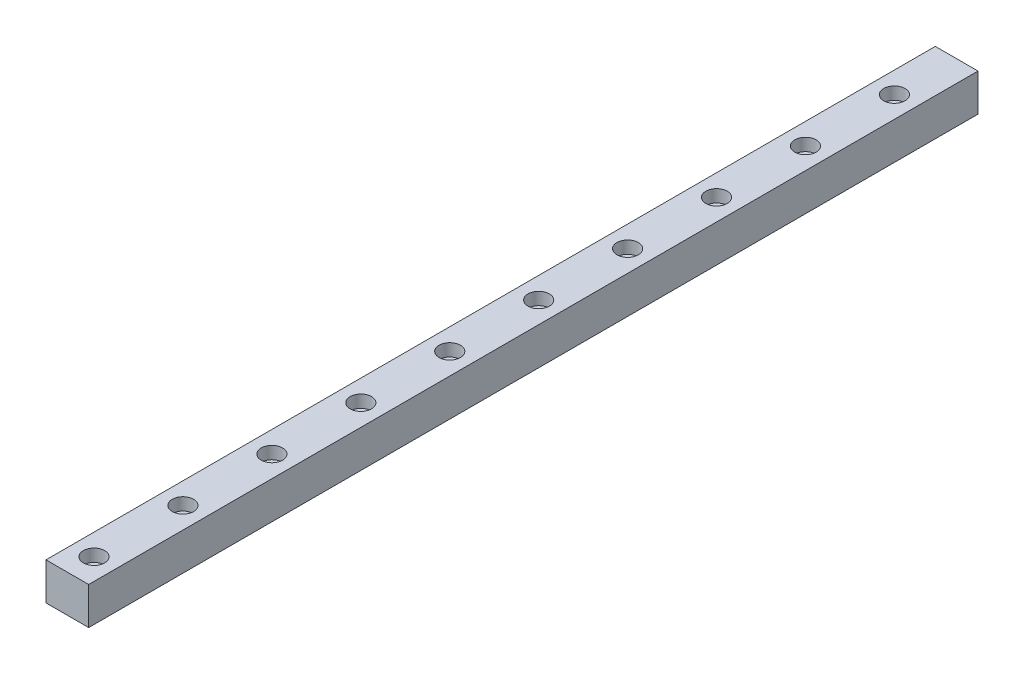
ISO-10303-21;
HEADER;
FILE_DESCRIPTION(('STEP AP214'),'2;1');
FILE_NAME('part.step','',(''),(''),'','','');
FILE_SCHEMA(('AUTOMOTIVE_DESIGN { 1 0 10303 214 1 1 1 1 }'));
ENDSEC;
DATA;
#1=APPLICATION_CONTEXT('core data for automotive mechanical design processes');
#2=APPLICATION_PROTOCOL_DEFINITION('international standard','automotive_design',2000,#1);
#3=PRODUCT_CONTEXT('',#1,'mechanical');
#4=PRODUCT('Part','Part','',(#3));
#5=PRODUCT_RELATED_PRODUCT_CATEGORY('part','',(#4));
#6=PRODUCT_DEFINITION_FORMATION('','',#4);
#7=PRODUCT_DEFINITION_CONTEXT('part definition',#1,'design');
#8=PRODUCT_DEFINITION('design','',#6,#7);
#9=PRODUCT_DEFINITION_SHAPE('','',#8);
#10=(LENGTH_UNIT() NAMED_UNIT(*) SI_UNIT(.MILLI.,.METRE.));
#11=(NAMED_UNIT(*) PLANE_ANGLE_UNIT() SI_UNIT($,.RADIAN.));
#12=(NAMED_UNIT(*) SI_UNIT($,.STERADIAN.) SOLID_ANGLE_UNIT());
#13=UNCERTAINTY_MEASURE_WITH_UNIT(LENGTH_MEASURE(1.E-05),#10,'distance_accuracy_value','');
#14=(GEOMETRIC_REPRESENTATION_CONTEXT(3) GLOBAL_UNCERTAINTY_ASSIGNED_CONTEXT((#13)) GLOBAL_UNIT_ASSIGNED_CONTEXT((#10,
#11,#12)) REPRESENTATION_CONTEXT('',''));
#15=CARTESIAN_POINT('',(0.,0.,0.));
#16=DIRECTION('',(0.,0.,1.));
#17=DIRECTION('',(1.,0.,0.));
#18=AXIS2_PLACEMENT_3D('',#15,#16,#17);
#19=CARTESIAN_POINT('',(0.,0.,250.));
#20=DIRECTION('',(1.,0.,0.));
#21=DIRECTION('',(0.,0.,-1.));
#22=AXIS2_PLACEMENT_3D('',#19,#20,#21);
#23=PLANE('',#22);
#24=DIRECTION('',(0.,-1.,0.));
#25=VECTOR('',#24,1.);
#26=CARTESIAN_POINT('',(0.,0.,0.));
#27=LINE('',#26,#25);
#28=CARTESIAN_POINT('',(0.,10.5,0.));
#29=VERTEX_POINT('',#28);
#30=CARTESIAN_POINT('',(0.,0.,0.));
#31=VERTEX_POINT('',#30);
#32=EDGE_CURVE('E101',#29,#31,#27,.T.);
#33=ORIENTED_EDGE('',*,*,#32,.T.);
#34=DIRECTION('',(0.,0.,-1.));
#35=VECTOR('',#34,1.);
#36=CARTESIAN_POINT('',(0.,0.,250.));
#37=LINE('',#36,#35);
#38=CARTESIAN_POINT('',(0.,0.,250.));
#39=VERTEX_POINT('',#38);
#40=EDGE_CURVE('E11',#39,#31,#37,.T.);
#41=ORIENTED_EDGE('',*,*,#40,.F.);
#42=DIRECTION('',(0.,-1.,0.));
#43=VECTOR('',#42,1.);
#44=CARTESIAN_POINT('',(0.,0.,250.));
#45=LINE('',#44,#43);
#46=CARTESIAN_POINT('',(0.,10.5,250.));
#47=VERTEX_POINT('',#46);
#48=EDGE_CURVE('E89',#47,#39,#45,.T.);
#49=ORIENTED_EDGE('',*,*,#48,.F.);
#50=DIRECTION('',(0.,0.,-1.));
#51=VECTOR('',#50,1.);
#52=CARTESIAN_POINT('',(0.,10.5,250.));
#53=LINE('',#52,#51);
#54=EDGE_CURVE('E97',#47,#29,#53,.T.);
#55=ORIENTED_EDGE('',*,*,#54,.T.);
#56=EDGE_LOOP('',(#33,#41,#49,#55));
#57=FACE_BOUND('',#56,.T.);
#58=ADVANCED_FACE('F38',(#57),#23,.F.);
#59=CARTESIAN_POINT('',(0.,0.,250.));
#60=DIRECTION('',(0.,1.,0.));
#61=DIRECTION('',(0.,0.,1.));
#62=AXIS2_PLACEMENT_3D('',#59,#60,#61);
#63=PLANE('',#62);
#64=CARTESIAN_POINT('',(6.00000000000001,0.,17.5));
#65=DIRECTION('',(0.,1.,0.));
#66=DIRECTION('',(0.,0.,1.));
#67=AXIS2_PLACEMENT_3D('',#64,#65,#66);
#68=CIRCLE('',#67,1.75);
#69=CARTESIAN_POINT('',(6.00000000000001,0.,19.25));
#70=VERTEX_POINT('',#69);
#71=EDGE_CURVE('E231',#70,#70,#68,.T.);
#72=ORIENTED_EDGE('',*,*,#71,.T.);
#73=EDGE_LOOP('',(#72));
#74=FACE_BOUND('',#73,.T.);
#75=CARTESIAN_POINT('',(6.00000000000001,0.,42.5));
#76=DIRECTION('',(0.,1.,0.));
#77=DIRECTION('',(0.,0.,1.));
#78=AXIS2_PLACEMENT_3D('',#75,#76,#77);
#79=CIRCLE('',#78,1.75);
#80=CARTESIAN_POINT('',(6.00000000000001,0.,44.25));
#81=VERTEX_POINT('',#80);
#82=EDGE_CURVE('E219',#81,#81,#79,.T.);
#83=ORIENTED_EDGE('',*,*,#82,.T.);
#84=EDGE_LOOP('',(#83));
#85=FACE_BOUND('',#84,.T.);
#86=CARTESIAN_POINT('',(6.00000000000001,0.,67.5));
#87=DIRECTION('',(0.,1.,0.));
#88=DIRECTION('',(0.,0.,1.));
#89=AXIS2_PLACEMENT_3D('',#86,#87,#88);
#90=CIRCLE('',#89,1.75);
#91=CARTESIAN_POINT('',(6.00000000000001,0.,69.25));
#92=VERTEX_POINT('',#91);
#93=EDGE_CURVE('E207',#92,#92,#90,.T.);
#94=ORIENTED_EDGE('',*,*,#93,.T.);
#95=EDGE_LOOP('',(#94));
#96=FACE_BOUND('',#95,.T.);
#97=CARTESIAN_POINT('',(6.00000000000001,0.,92.5));
#98=DIRECTION('',(0.,1.,0.));
#99=DIRECTION('',(0.,0.,1.));
#100=AXIS2_PLACEMENT_3D('',#97,#98,#99);
#101=CIRCLE('',#100,1.75);
#102=CARTESIAN_POINT('',(6.00000000000001,0.,94.25));
#103=VERTEX_POINT('',#102);
#104=EDGE_CURVE('E195',#103,#103,#101,.T.);
#105=ORIENTED_EDGE('',*,*,#104,.T.);
#106=EDGE_LOOP('',(#105));
#107=FACE_BOUND('',#106,.T.);
#108=CARTESIAN_POINT('',(6.00000000000001,0.,117.5));
#109=DIRECTION('',(0.,1.,0.));
#110=DIRECTION('',(0.,0.,1.));
#111=AXIS2_PLACEMENT_3D('',#108,#109,#110);
#112=CIRCLE('',#111,1.75);
#113=CARTESIAN_POINT('',(6.00000000000001,0.,119.25));
#114=VERTEX_POINT('',#113);
#115=EDGE_CURVE('E183',#114,#114,#112,.T.);
#116=ORIENTED_EDGE('',*,*,#115,.T.);
#117=EDGE_LOOP('',(#116));
#118=FACE_BOUND('',#117,.T.);
#119=CARTESIAN_POINT('',(6.00000000000001,0.,142.5));
#120=DIRECTION('',(0.,1.,0.));
#121=DIRECTION('',(0.,0.,1.));
#122=AXIS2_PLACEMENT_3D('',#119,#120,#121);
#123=CIRCLE('',#122,1.75);
#124=CARTESIAN_POINT('',(6.00000000000001,0.,144.25));
#125=VERTEX_POINT('',#124);
#126=EDGE_CURVE('E171',#125,#125,#123,.T.);
#127=ORIENTED_EDGE('',*,*,#126,.T.);
#128=EDGE_LOOP('',(#127));
#129=FACE_BOUND('',#128,.T.);
#130=CARTESIAN_POINT('',(6.00000000000001,0.,167.5));
#131=DIRECTION('',(0.,1.,0.));
#132=DIRECTION('',(0.,0.,1.));
#133=AXIS2_PLACEMENT_3D('',#130,#131,#132);
#134=CIRCLE('',#133,1.75);
#135=CARTESIAN_POINT('',(6.00000000000001,0.,169.25));
#136=VERTEX_POINT('',#135);
#137=EDGE_CURVE('E159',#136,#136,#134,.T.);
#138=ORIENTED_EDGE('',*,*,#137,.T.);
#139=EDGE_LOOP('',(#138));
#140=FACE_BOUND('',#139,.T.);
#141=CARTESIAN_POINT('',(6.00000000000001,0.,192.5));
#142=DIRECTION('',(0.,1.,0.));
#143=DIRECTION('',(0.,0.,1.));
#144=AXIS2_PLACEMENT_3D('',#141,#142,#143);
#145=CIRCLE('',#144,1.75);
#146=CARTESIAN_POINT('',(6.00000000000001,0.,194.25));
#147=VERTEX_POINT('',#146);
#148=EDGE_CURVE('E147',#147,#147,#145,.T.);
#149=ORIENTED_EDGE('',*,*,#148,.T.);
#150=EDGE_LOOP('',(#149));
#151=FACE_BOUND('',#150,.T.);
#152=CARTESIAN_POINT('',(6.00000000000001,0.,217.5));
#153=DIRECTION('',(0.,1.,0.));
#154=DIRECTION('',(0.,0.,1.));
#155=AXIS2_PLACEMENT_3D('',#152,#153,#154);
#156=CIRCLE('',#155,1.75);
#157=CARTESIAN_POINT('',(6.00000000000001,0.,219.25));
#158=VERTEX_POINT('',#157);
#159=EDGE_CURVE('E135',#158,#158,#156,.T.);
#160=ORIENTED_EDGE('',*,*,#159,.T.);
#161=EDGE_LOOP('',(#160));
#162=FACE_BOUND('',#161,.T.);
#163=CARTESIAN_POINT('',(6.00000000000001,0.,242.5));
#164=DIRECTION('',(0.,1.,0.));
#165=DIRECTION('',(0.,0.,1.));
#166=AXIS2_PLACEMENT_3D('',#163,#164,#165);
#167=CIRCLE('',#166,1.75);
#168=CARTESIAN_POINT('',(6.00000000000001,0.,244.25));
#169=VERTEX_POINT('',#168);
#170=EDGE_CURVE('E118',#169,#169,#167,.T.);
#171=ORIENTED_EDGE('',*,*,#170,.T.);
#172=EDGE_LOOP('',(#171));
#173=FACE_BOUND('',#172,.T.);
#174=DIRECTION('',(1.,0.,0.));
#175=VECTOR('',#174,1.);
#176=CARTESIAN_POINT('',(0.,0.,0.));
#177=LINE('',#176,#175);
#178=CARTESIAN_POINT('',(12.,0.,0.));
#179=VERTEX_POINT('',#178);
#180=EDGE_CURVE('E93',#31,#179,#177,.T.);
#181=ORIENTED_EDGE('',*,*,#180,.T.);
#182=DIRECTION('',(0.,0.,-1.));
#183=VECTOR('',#182,1.);
#184=CARTESIAN_POINT('',(12.,0.,250.));
#185=LINE('',#184,#183);
#186=CARTESIAN_POINT('',(12.,0.,250.));
#187=VERTEX_POINT('',#186);
#188=EDGE_CURVE('E46',#187,#179,#185,.T.);
#189=ORIENTED_EDGE('',*,*,#188,.F.);
#190=DIRECTION('',(1.,0.,0.));
#191=VECTOR('',#190,1.);
#192=CARTESIAN_POINT('',(0.,0.,250.));
#193=LINE('',#192,#191);
#194=EDGE_CURVE('E84',#39,#187,#193,.T.);
#195=ORIENTED_EDGE('',*,*,#194,.F.);
#196=ORIENTED_EDGE('',*,*,#40,.T.);
#197=EDGE_LOOP('',(#181,#189,#195,#196));
#198=FACE_BOUND('',#197,.T.);
#199=ADVANCED_FACE('F92',(#74,#85,#96,#107,#118,#129,#140,#151,#162,#173,#198),#63,.F.);
#200=CARTESIAN_POINT('',(12.,0.,250.));
#201=DIRECTION('',(-1.,0.,0.));
#202=DIRECTION('',(0.,0.,1.));
#203=AXIS2_PLACEMENT_3D('',#200,#201,#202);
#204=PLANE('',#203);
#205=DIRECTION('',(0.,1.,0.));
#206=VECTOR('',#205,1.);
#207=CARTESIAN_POINT('',(12.,0.,0.));
#208=LINE('',#207,#206);
#209=CARTESIAN_POINT('',(12.,10.5,0.));
#210=VERTEX_POINT('',#209);
#211=EDGE_CURVE('E71',#179,#210,#208,.T.);
#212=ORIENTED_EDGE('',*,*,#211,.T.);
#213=DIRECTION('',(0.,0.,-1.));
#214=VECTOR('',#213,1.);
#215=CARTESIAN_POINT('',(12.,10.5,250.));
#216=LINE('',#215,#214);
#217=CARTESIAN_POINT('',(12.,10.5,250.));
#218=VERTEX_POINT('',#217);
#219=EDGE_CURVE('E94',#218,#210,#216,.T.);
#220=ORIENTED_EDGE('',*,*,#219,.F.);
#221=DIRECTION('',(0.,1.,0.));
#222=VECTOR('',#221,1.);
#223=CARTESIAN_POINT('',(12.,0.,250.));
#224=LINE('',#223,#222);
#225=EDGE_CURVE('E87',#187,#218,#224,.T.);
#226=ORIENTED_EDGE('',*,*,#225,.F.);
#227=ORIENTED_EDGE('',*,*,#188,.T.);
#228=EDGE_LOOP('',(#212,#220,#226,#227));
#229=FACE_BOUND('',#228,.T.);
#230=ADVANCED_FACE('F95',(#229),#204,.F.);
#231=CARTESIAN_POINT('',(0.,10.5,250.));
#232=DIRECTION('',(0.,-1.,0.));
#233=DIRECTION('',(0.,0.,-1.));
#234=AXIS2_PLACEMENT_3D('',#231,#232,#233);
#235=PLANE('',#234);
#236=CARTESIAN_POINT('',(6.00000000000001,10.5,17.5));
#237=DIRECTION('',(0.,1.,0.));
#238=DIRECTION('',(0.,0.,1.));
#239=AXIS2_PLACEMENT_3D('',#236,#237,#238);
#240=CIRCLE('',#239,3.);
#241=CARTESIAN_POINT('',(6.00000000000001,10.5,20.5));
#242=VERTEX_POINT('',#241);
#243=EDGE_CURVE('E228',#242,#242,#240,.T.);
#244=ORIENTED_EDGE('',*,*,#243,.F.);
#245=EDGE_LOOP('',(#244));
#246=FACE_BOUND('',#245,.T.);
#247=CARTESIAN_POINT('',(6.00000000000001,10.5,42.5));
#248=DIRECTION('',(0.,1.,0.));
#249=DIRECTION('',(0.,0.,1.));
#250=AXIS2_PLACEMENT_3D('',#247,#248,#249);
#251=CIRCLE('',#250,3.);
#252=CARTESIAN_POINT('',(6.00000000000001,10.5,45.5));
#253=VERTEX_POINT('',#252);
#254=EDGE_CURVE('E216',#253,#253,#251,.T.);
#255=ORIENTED_EDGE('',*,*,#254,.F.);
#256=EDGE_LOOP('',(#255));
#257=FACE_BOUND('',#256,.T.);
#258=CARTESIAN_POINT('',(6.00000000000001,10.5,67.5));
#259=DIRECTION('',(0.,1.,0.));
#260=DIRECTION('',(0.,0.,1.));
#261=AXIS2_PLACEMENT_3D('',#258,#259,#260);
#262=CIRCLE('',#261,3.);
#263=CARTESIAN_POINT('',(6.00000000000001,10.5,70.5));
#264=VERTEX_POINT('',#263);
#265=EDGE_CURVE('E204',#264,#264,#262,.T.);
#266=ORIENTED_EDGE('',*,*,#265,.F.);
#267=EDGE_LOOP('',(#266));
#268=FACE_BOUND('',#267,.T.);
#269=CARTESIAN_POINT('',(6.00000000000001,10.5,92.5));
#270=DIRECTION('',(0.,1.,0.));
#271=DIRECTION('',(0.,0.,1.));
#272=AXIS2_PLACEMENT_3D('',#269,#270,#271);
#273=CIRCLE('',#272,3.);
#274=CARTESIAN_POINT('',(6.00000000000001,10.5,95.5));
#275=VERTEX_POINT('',#274);
#276=EDGE_CURVE('E192',#275,#275,#273,.T.);
#277=ORIENTED_EDGE('',*,*,#276,.F.);
#278=EDGE_LOOP('',(#277));
#279=FACE_BOUND('',#278,.T.);
#280=CARTESIAN_POINT('',(6.00000000000001,10.5,117.5));
#281=DIRECTION('',(0.,1.,0.));
#282=DIRECTION('',(0.,0.,1.));
#283=AXIS2_PLACEMENT_3D('',#280,#281,#282);
#284=CIRCLE('',#283,3.);
#285=CARTESIAN_POINT('',(6.00000000000001,10.5,120.5));
#286=VERTEX_POINT('',#285);
#287=EDGE_CURVE('E180',#286,#286,#284,.T.);
#288=ORIENTED_EDGE('',*,*,#287,.F.);
#289=EDGE_LOOP('',(#288));
#290=FACE_BOUND('',#289,.T.);
#291=CARTESIAN_POINT('',(6.00000000000001,10.5,142.5));
#292=DIRECTION('',(0.,1.,0.));
#293=DIRECTION('',(0.,0.,1.));
#294=AXIS2_PLACEMENT_3D('',#291,#292,#293);
#295=CIRCLE('',#294,3.);
#296=CARTESIAN_POINT('',(6.00000000000001,10.5,145.5));
#297=VERTEX_POINT('',#296);
#298=EDGE_CURVE('E168',#297,#297,#295,.T.);
#299=ORIENTED_EDGE('',*,*,#298,.F.);
#300=EDGE_LOOP('',(#299));
#301=FACE_BOUND('',#300,.T.);
#302=CARTESIAN_POINT('',(6.00000000000001,10.5,167.5));
#303=DIRECTION('',(0.,1.,0.));
#304=DIRECTION('',(0.,0.,1.));
#305=AXIS2_PLACEMENT_3D('',#302,#303,#304);
#306=CIRCLE('',#305,3.);
#307=CARTESIAN_POINT('',(6.00000000000001,10.5,170.5));
#308=VERTEX_POINT('',#307);
#309=EDGE_CURVE('E156',#308,#308,#306,.T.);
#310=ORIENTED_EDGE('',*,*,#309,.F.);
#311=EDGE_LOOP('',(#310));
#312=FACE_BOUND('',#311,.T.);
#313=CARTESIAN_POINT('',(6.00000000000001,10.5,192.5));
#314=DIRECTION('',(0.,1.,0.));
#315=DIRECTION('',(0.,0.,1.));
#316=AXIS2_PLACEMENT_3D('',#313,#314,#315);
#317=CIRCLE('',#316,3.);
#318=CARTESIAN_POINT('',(6.00000000000001,10.5,195.5));
#319=VERTEX_POINT('',#318);
#320=EDGE_CURVE('E144',#319,#319,#317,.T.);
#321=ORIENTED_EDGE('',*,*,#320,.F.);
#322=EDGE_LOOP('',(#321));
#323=FACE_BOUND('',#322,.T.);
#324=CARTESIAN_POINT('',(6.00000000000001,10.5,217.5));
#325=DIRECTION('',(0.,1.,0.));
#326=DIRECTION('',(0.,0.,1.));
#327=AXIS2_PLACEMENT_3D('',#324,#325,#326);
#328=CIRCLE('',#327,3.);
#329=CARTESIAN_POINT('',(6.00000000000001,10.5,220.5));
#330=VERTEX_POINT('',#329);
#331=EDGE_CURVE('E132',#330,#330,#328,.T.);
#332=ORIENTED_EDGE('',*,*,#331,.F.);
#333=EDGE_LOOP('',(#332));
#334=FACE_BOUND('',#333,.T.);
#335=CARTESIAN_POINT('',(6.00000000000001,10.5,242.5));
#336=DIRECTION('',(0.,1.,0.));
#337=DIRECTION('',(0.,0.,1.));
#338=AXIS2_PLACEMENT_3D('',#335,#336,#337);
#339=CIRCLE('',#338,3.);
#340=CARTESIAN_POINT('',(6.00000000000001,10.5,245.5));
#341=VERTEX_POINT('',#340);
#342=EDGE_CURVE('E115',#341,#341,#339,.T.);
#343=ORIENTED_EDGE('',*,*,#342,.F.);
#344=EDGE_LOOP('',(#343));
#345=FACE_BOUND('',#344,.T.);
#346=DIRECTION('',(-1.,0.,0.));
#347=VECTOR('',#346,1.);
#348=CARTESIAN_POINT('',(0.,10.5,0.));
#349=LINE('',#348,#347);
#350=EDGE_CURVE('E77',#210,#29,#349,.T.);
#351=ORIENTED_EDGE('',*,*,#350,.T.);
#352=ORIENTED_EDGE('',*,*,#54,.F.);
#353=DIRECTION('',(-1.,0.,0.));
#354=VECTOR('',#353,1.);
#355=CARTESIAN_POINT('',(0.,10.5,250.));
#356=LINE('',#355,#354);
#357=EDGE_CURVE('E54',#218,#47,#356,.T.);
#358=ORIENTED_EDGE('',*,*,#357,.F.);
#359=ORIENTED_EDGE('',*,*,#219,.T.);
#360=EDGE_LOOP('',(#351,#352,#358,#359));
#361=FACE_BOUND('',#360,.T.);
#362=ADVANCED_FACE('F109',(#246,#257,#268,#279,#290,#301,#312,#323,#334,#345,#361),#235,.F.);
#363=CARTESIAN_POINT('',(0.,0.,250.));
#364=DIRECTION('',(0.,0.,-1.));
#365=DIRECTION('',(-1.,0.,0.));
#366=AXIS2_PLACEMENT_3D('',#363,#364,#365);
#367=PLANE('',#366);
#368=ORIENTED_EDGE('',*,*,#48,.T.);
#369=ORIENTED_EDGE('',*,*,#194,.T.);
#370=ORIENTED_EDGE('',*,*,#225,.T.);
#371=ORIENTED_EDGE('',*,*,#357,.T.);
#372=EDGE_LOOP('',(#368,#369,#370,#371));
#373=FACE_BOUND('',#372,.T.);
#374=ADVANCED_FACE('F85',(#373),#367,.F.);
#375=CARTESIAN_POINT('',(0.,0.,0.));
#376=DIRECTION('',(0.,0.,-1.));
#377=DIRECTION('',(-1.,0.,0.));
#378=AXIS2_PLACEMENT_3D('',#375,#376,#377);
#379=PLANE('',#378);
#380=ORIENTED_EDGE('',*,*,#32,.F.);
#381=ORIENTED_EDGE('',*,*,#350,.F.);
#382=ORIENTED_EDGE('',*,*,#211,.F.);
#383=ORIENTED_EDGE('',*,*,#180,.F.);
#384=EDGE_LOOP('',(#380,#381,#382,#383));
#385=FACE_BOUND('',#384,.T.);
#386=ADVANCED_FACE('F112',(#385),#379,.T.);
#387=CARTESIAN_POINT('',(6.00000000000001,7.,242.5));
#388=DIRECTION('',(0.,1.,0.));
#389=DIRECTION('',(0.,0.,1.));
#390=AXIS2_PLACEMENT_3D('',#387,#388,#389);
#391=CYLINDRICAL_SURFACE('',#390,3.);
#392=CARTESIAN_POINT('',(6.00000000000001,7.,242.5));
#393=DIRECTION('',(0.,1.,0.));
#394=DIRECTION('',(0.,0.,1.));
#395=AXIS2_PLACEMENT_3D('',#392,#393,#394);
#396=CIRCLE('',#395,3.);
#397=CARTESIAN_POINT('',(6.00000000000001,7.,245.5));
#398=VERTEX_POINT('',#397);
#399=EDGE_CURVE('E104',#398,#398,#396,.T.);
#400=ORIENTED_EDGE('',*,*,#399,.F.);
#401=EDGE_LOOP('',(#400));
#402=FACE_BOUND('',#401,.T.);
#403=ORIENTED_EDGE('',*,*,#342,.T.);
#404=EDGE_LOOP('',(#403));
#405=FACE_BOUND('',#404,.T.);
#406=ADVANCED_FACE('F277',(#402,#405),#391,.F.);
#407=CARTESIAN_POINT('',(6.00000000000001,7.,242.5));
#408=DIRECTION('',(0.,1.,0.));
#409=DIRECTION('',(0.,0.,1.));
#410=AXIS2_PLACEMENT_3D('',#407,#408,#409);
#411=PLANE('',#410);
#412=CARTESIAN_POINT('',(6.00000000000001,7.,242.5));
#413=DIRECTION('',(0.,1.,0.));
#414=DIRECTION('',(0.,0.,1.));
#415=AXIS2_PLACEMENT_3D('',#412,#413,#414);
#416=CIRCLE('',#415,1.75);
#417=CARTESIAN_POINT('',(6.00000000000001,7.,244.25));
#418=VERTEX_POINT('',#417);
#419=EDGE_CURVE('E121',#418,#418,#416,.T.);
#420=ORIENTED_EDGE('',*,*,#419,.F.);
#421=EDGE_LOOP('',(#420));
#422=FACE_BOUND('',#421,.T.);
#423=ORIENTED_EDGE('',*,*,#399,.T.);
#424=EDGE_LOOP('',(#423));
#425=FACE_BOUND('',#424,.T.);
#426=ADVANCED_FACE('F279',(#422,#425),#411,.T.);
#427=CARTESIAN_POINT('',(6.00000000000001,0.,242.5));
#428=DIRECTION('',(0.,1.,0.));
#429=DIRECTION('',(0.,0.,1.));
#430=AXIS2_PLACEMENT_3D('',#427,#428,#429);
#431=CYLINDRICAL_SURFACE('',#430,1.75);
#432=ORIENTED_EDGE('',*,*,#170,.F.);
#433=EDGE_LOOP('',(#432));
#434=FACE_BOUND('',#433,.T.);
#435=ORIENTED_EDGE('',*,*,#419,.T.);
#436=EDGE_LOOP('',(#435));
#437=FACE_BOUND('',#436,.T.);
#438=ADVANCED_FACE('F286',(#434,#437),#431,.F.);
#439=CARTESIAN_POINT('',(6.00000000000001,7.,217.5));
#440=DIRECTION('',(0.,1.,0.));
#441=DIRECTION('',(0.,0.,1.));
#442=AXIS2_PLACEMENT_3D('',#439,#440,#441);
#443=CYLINDRICAL_SURFACE('',#442,3.);
#444=CARTESIAN_POINT('',(6.00000000000001,7.,217.5));
#445=DIRECTION('',(0.,1.,0.));
#446=DIRECTION('',(0.,0.,1.));
#447=AXIS2_PLACEMENT_3D('',#444,#445,#446);
#448=CIRCLE('',#447,3.);
#449=CARTESIAN_POINT('',(6.00000000000001,7.,220.5));
#450=VERTEX_POINT('',#449);
#451=EDGE_CURVE('E124',#450,#450,#448,.T.);
#452=ORIENTED_EDGE('',*,*,#451,.F.);
#453=EDGE_LOOP('',(#452));
#454=FACE_BOUND('',#453,.T.);
#455=ORIENTED_EDGE('',*,*,#331,.T.);
#456=EDGE_LOOP('',(#455));
#457=FACE_BOUND('',#456,.T.);
#458=ADVANCED_FACE('F331',(#454,#457),#443,.F.);
#459=CARTESIAN_POINT('',(6.00000000000001,7.,217.5));
#460=DIRECTION('',(0.,1.,0.));
#461=DIRECTION('',(0.,0.,1.));
#462=AXIS2_PLACEMENT_3D('',#459,#460,#461);
#463=PLANE('',#462);
#464=CARTESIAN_POINT('',(6.00000000000001,7.,217.5));
#465=DIRECTION('',(0.,1.,0.));
#466=DIRECTION('',(0.,0.,1.));
#467=AXIS2_PLACEMENT_3D('',#464,#465,#466);
#468=CIRCLE('',#467,1.75);
#469=CARTESIAN_POINT('',(6.00000000000001,7.,219.25));
#470=VERTEX_POINT('',#469);
#471=EDGE_CURVE('E129',#470,#470,#468,.T.);
#472=ORIENTED_EDGE('',*,*,#471,.F.);
#473=EDGE_LOOP('',(#472));
#474=FACE_BOUND('',#473,.T.);
#475=ORIENTED_EDGE('',*,*,#451,.T.);
#476=EDGE_LOOP('',(#475));
#477=FACE_BOUND('',#476,.T.);
#478=ADVANCED_FACE('F355',(#474,#477),#463,.T.);
#479=CARTESIAN_POINT('',(6.00000000000001,0.,217.5));
#480=DIRECTION('',(0.,1.,0.));
#481=DIRECTION('',(0.,0.,1.));
#482=AXIS2_PLACEMENT_3D('',#479,#480,#481);
#483=CYLINDRICAL_SURFACE('',#482,1.75);
#484=ORIENTED_EDGE('',*,*,#159,.F.);
#485=EDGE_LOOP('',(#484));
#486=FACE_BOUND('',#485,.T.);
#487=ORIENTED_EDGE('',*,*,#471,.T.);
#488=EDGE_LOOP('',(#487));
#489=FACE_BOUND('',#488,.T.);
#490=ADVANCED_FACE('F366',(#486,#489),#483,.F.);
#491=CARTESIAN_POINT('',(6.00000000000001,7.,192.5));
#492=DIRECTION('',(0.,1.,0.));
#493=DIRECTION('',(0.,0.,1.));
#494=AXIS2_PLACEMENT_3D('',#491,#492,#493);
#495=CYLINDRICAL_SURFACE('',#494,3.);
#496=CARTESIAN_POINT('',(6.00000000000001,7.,192.5));
#497=DIRECTION('',(0.,1.,0.));
#498=DIRECTION('',(0.,0.,1.));
#499=AXIS2_PLACEMENT_3D('',#496,#497,#498);
#500=CIRCLE('',#499,3.);
#501=CARTESIAN_POINT('',(6.00000000000001,7.,195.5));
#502=VERTEX_POINT('',#501);
#503=EDGE_CURVE('E138',#502,#502,#500,.T.);
#504=ORIENTED_EDGE('',*,*,#503,.F.);
#505=EDGE_LOOP('',(#504));
#506=FACE_BOUND('',#505,.T.);
#507=ORIENTED_EDGE('',*,*,#320,.T.);
#508=EDGE_LOOP('',(#507));
#509=FACE_BOUND('',#508,.T.);
#510=ADVANCED_FACE('F377',(#506,#509),#495,.F.);
#511=CARTESIAN_POINT('',(6.00000000000001,7.,192.5));
#512=DIRECTION('',(0.,1.,0.));
#513=DIRECTION('',(0.,0.,1.));
#514=AXIS2_PLACEMENT_3D('',#511,#512,#513);
#515=PLANE('',#514);
#516=CARTESIAN_POINT('',(6.00000000000001,7.,192.5));
#517=DIRECTION('',(0.,1.,0.));
#518=DIRECTION('',(0.,0.,1.));
#519=AXIS2_PLACEMENT_3D('',#516,#517,#518);
#520=CIRCLE('',#519,1.75);
#521=CARTESIAN_POINT('',(6.00000000000001,7.,194.25));
#522=VERTEX_POINT('',#521);
#523=EDGE_CURVE('E141',#522,#522,#520,.T.);
#524=ORIENTED_EDGE('',*,*,#523,.F.);
#525=EDGE_LOOP('',(#524));
#526=FACE_BOUND('',#525,.T.);
#527=ORIENTED_EDGE('',*,*,#503,.T.);
#528=EDGE_LOOP('',(#527));
#529=FACE_BOUND('',#528,.T.);
#530=ADVANCED_FACE('F388',(#526,#529),#515,.T.);
#531=CARTESIAN_POINT('',(6.00000000000001,0.,192.5));
#532=DIRECTION('',(0.,1.,0.));
#533=DIRECTION('',(0.,0.,1.));
#534=AXIS2_PLACEMENT_3D('',#531,#532,#533);
#535=CYLINDRICAL_SURFACE('',#534,1.75);
#536=ORIENTED_EDGE('',*,*,#148,.F.);
#537=EDGE_LOOP('',(#536));
#538=FACE_BOUND('',#537,.T.);
#539=ORIENTED_EDGE('',*,*,#523,.T.);
#540=EDGE_LOOP('',(#539));
#541=FACE_BOUND('',#540,.T.);
#542=ADVANCED_FACE('F399',(#538,#541),#535,.F.);
#543=CARTESIAN_POINT('',(6.00000000000001,7.,167.5));
#544=DIRECTION('',(0.,1.,0.));
#545=DIRECTION('',(0.,0.,1.));
#546=AXIS2_PLACEMENT_3D('',#543,#544,#545);
#547=CYLINDRICAL_SURFACE('',#546,3.);
#548=CARTESIAN_POINT('',(6.00000000000001,7.,167.5));
#549=DIRECTION('',(0.,1.,0.));
#550=DIRECTION('',(0.,0.,1.));
#551=AXIS2_PLACEMENT_3D('',#548,#549,#550);
#552=CIRCLE('',#551,3.);
#553=CARTESIAN_POINT('',(6.00000000000001,7.,170.5));
#554=VERTEX_POINT('',#553);
#555=EDGE_CURVE('E150',#554,#554,#552,.T.);
#556=ORIENTED_EDGE('',*,*,#555,.F.);
#557=EDGE_LOOP('',(#556));
#558=FACE_BOUND('',#557,.T.);
#559=ORIENTED_EDGE('',*,*,#309,.T.);
#560=EDGE_LOOP('',(#559));
#561=FACE_BOUND('',#560,.T.);
#562=ADVANCED_FACE('F410',(#558,#561),#547,.F.);
#563=CARTESIAN_POINT('',(6.00000000000001,7.,167.5));
#564=DIRECTION('',(0.,1.,0.));
#565=DIRECTION('',(0.,0.,1.));
#566=AXIS2_PLACEMENT_3D('',#563,#564,#565);
#567=PLANE('',#566);
#568=CARTESIAN_POINT('',(6.00000000000001,7.,167.5));
#569=DIRECTION('',(0.,1.,0.));
#570=DIRECTION('',(0.,0.,1.));
#571=AXIS2_PLACEMENT_3D('',#568,#569,#570);
#572=CIRCLE('',#571,1.75);
#573=CARTESIAN_POINT('',(6.00000000000001,7.,169.25));
#574=VERTEX_POINT('',#573);
#575=EDGE_CURVE('E153',#574,#574,#572,.T.);
#576=ORIENTED_EDGE('',*,*,#575,.F.);
#577=EDGE_LOOP('',(#576));
#578=FACE_BOUND('',#577,.T.);
#579=ORIENTED_EDGE('',*,*,#555,.T.);
#580=EDGE_LOOP('',(#579));
#581=FACE_BOUND('',#580,.T.);
#582=ADVANCED_FACE('F421',(#578,#581),#567,.T.);
#583=CARTESIAN_POINT('',(6.00000000000001,0.,167.5));
#584=DIRECTION('',(0.,1.,0.));
#585=DIRECTION('',(0.,0.,1.));
#586=AXIS2_PLACEMENT_3D('',#583,#584,#585);
#587=CYLINDRICAL_SURFACE('',#586,1.75);
#588=ORIENTED_EDGE('',*,*,#137,.F.);
#589=EDGE_LOOP('',(#588));
#590=FACE_BOUND('',#589,.T.);
#591=ORIENTED_EDGE('',*,*,#575,.T.);
#592=EDGE_LOOP('',(#591));
#593=FACE_BOUND('',#592,.T.);
#594=ADVANCED_FACE('F432',(#590,#593),#587,.F.);
#595=CARTESIAN_POINT('',(6.00000000000001,7.,142.5));
#596=DIRECTION('',(0.,1.,0.));
#597=DIRECTION('',(0.,0.,1.));
#598=AXIS2_PLACEMENT_3D('',#595,#596,#597);
#599=CYLINDRICAL_SURFACE('',#598,3.);
#600=CARTESIAN_POINT('',(6.00000000000001,7.,142.5));
#601=DIRECTION('',(0.,1.,0.));
#602=DIRECTION('',(0.,0.,1.));
#603=AXIS2_PLACEMENT_3D('',#600,#601,#602);
#604=CIRCLE('',#603,3.);
#605=CARTESIAN_POINT('',(6.00000000000001,7.,145.5));
#606=VERTEX_POINT('',#605);
#607=EDGE_CURVE('E162',#606,#606,#604,.T.);
#608=ORIENTED_EDGE('',*,*,#607,.F.);
#609=EDGE_LOOP('',(#608));
#610=FACE_BOUND('',#609,.T.);
#611=ORIENTED_EDGE('',*,*,#298,.T.);
#612=EDGE_LOOP('',(#611));
#613=FACE_BOUND('',#612,.T.);
#614=ADVANCED_FACE('F443',(#610,#613),#599,.F.);
#615=CARTESIAN_POINT('',(6.00000000000001,7.,142.5));
#616=DIRECTION('',(0.,1.,0.));
#617=DIRECTION('',(0.,0.,1.));
#618=AXIS2_PLACEMENT_3D('',#615,#616,#617);
#619=PLANE('',#618);
#620=CARTESIAN_POINT('',(6.00000000000001,7.,142.5));
#621=DIRECTION('',(0.,1.,0.));
#622=DIRECTION('',(0.,0.,1.));
#623=AXIS2_PLACEMENT_3D('',#620,#621,#622);
#624=CIRCLE('',#623,1.75);
#625=CARTESIAN_POINT('',(6.00000000000001,7.,144.25));
#626=VERTEX_POINT('',#625);
#627=EDGE_CURVE('E165',#626,#626,#624,.T.);
#628=ORIENTED_EDGE('',*,*,#627,.F.);
#629=EDGE_LOOP('',(#628));
#630=FACE_BOUND('',#629,.T.);
#631=ORIENTED_EDGE('',*,*,#607,.T.);
#632=EDGE_LOOP('',(#631));
#633=FACE_BOUND('',#632,.T.);
#634=ADVANCED_FACE('F454',(#630,#633),#619,.T.);
#635=CARTESIAN_POINT('',(6.00000000000001,0.,142.5));
#636=DIRECTION('',(0.,1.,0.));
#637=DIRECTION('',(0.,0.,1.));
#638=AXIS2_PLACEMENT_3D('',#635,#636,#637);
#639=CYLINDRICAL_SURFACE('',#638,1.75);
#640=ORIENTED_EDGE('',*,*,#126,.F.);
#641=EDGE_LOOP('',(#640));
#642=FACE_BOUND('',#641,.T.);
#643=ORIENTED_EDGE('',*,*,#627,.T.);
#644=EDGE_LOOP('',(#643));
#645=FACE_BOUND('',#644,.T.);
#646=ADVANCED_FACE('F465',(#642,#645),#639,.F.);
#647=CARTESIAN_POINT('',(6.00000000000001,7.,117.5));
#648=DIRECTION('',(0.,1.,0.));
#649=DIRECTION('',(0.,0.,1.));
#650=AXIS2_PLACEMENT_3D('',#647,#648,#649);
#651=CYLINDRICAL_SURFACE('',#650,3.);
#652=CARTESIAN_POINT('',(6.00000000000001,7.,117.5));
#653=DIRECTION('',(0.,1.,0.));
#654=DIRECTION('',(0.,0.,1.));
#655=AXIS2_PLACEMENT_3D('',#652,#653,#654);
#656=CIRCLE('',#655,3.);
#657=CARTESIAN_POINT('',(6.00000000000001,7.,120.5));
#658=VERTEX_POINT('',#657);
#659=EDGE_CURVE('E174',#658,#658,#656,.T.);
#660=ORIENTED_EDGE('',*,*,#659,.F.);
#661=EDGE_LOOP('',(#660));
#662=FACE_BOUND('',#661,.T.);
#663=ORIENTED_EDGE('',*,*,#287,.T.);
#664=EDGE_LOOP('',(#663));
#665=FACE_BOUND('',#664,.T.);
#666=ADVANCED_FACE('F476',(#662,#665),#651,.F.);
#667=CARTESIAN_POINT('',(6.00000000000001,7.,117.5));
#668=DIRECTION('',(0.,1.,0.));
#669=DIRECTION('',(0.,0.,1.));
#670=AXIS2_PLACEMENT_3D('',#667,#668,#669);
#671=PLANE('',#670);
#672=CARTESIAN_POINT('',(6.00000000000001,7.,117.5));
#673=DIRECTION('',(0.,1.,0.));
#674=DIRECTION('',(0.,0.,1.));
#675=AXIS2_PLACEMENT_3D('',#672,#673,#674);
#676=CIRCLE('',#675,1.75);
#677=CARTESIAN_POINT('',(6.00000000000001,7.,119.25));
#678=VERTEX_POINT('',#677);
#679=EDGE_CURVE('E177',#678,#678,#676,.T.);
#680=ORIENTED_EDGE('',*,*,#679,.F.);
#681=EDGE_LOOP('',(#680));
#682=FACE_BOUND('',#681,.T.);
#683=ORIENTED_EDGE('',*,*,#659,.T.);
#684=EDGE_LOOP('',(#683));
#685=FACE_BOUND('',#684,.T.);
#686=ADVANCED_FACE('F487',(#682,#685),#671,.T.);
#687=CARTESIAN_POINT('',(6.00000000000001,0.,117.5));
#688=DIRECTION('',(0.,1.,0.));
#689=DIRECTION('',(0.,0.,1.));
#690=AXIS2_PLACEMENT_3D('',#687,#688,#689);
#691=CYLINDRICAL_SURFACE('',#690,1.75);
#692=ORIENTED_EDGE('',*,*,#115,.F.);
#693=EDGE_LOOP('',(#692));
#694=FACE_BOUND('',#693,.T.);
#695=ORIENTED_EDGE('',*,*,#679,.T.);
#696=EDGE_LOOP('',(#695));
#697=FACE_BOUND('',#696,.T.);
#698=ADVANCED_FACE('F498',(#694,#697),#691,.F.);
#699=CARTESIAN_POINT('',(6.00000000000001,7.,92.5));
#700=DIRECTION('',(0.,1.,0.));
#701=DIRECTION('',(0.,0.,1.));
#702=AXIS2_PLACEMENT_3D('',#699,#700,#701);
#703=CYLINDRICAL_SURFACE('',#702,3.);
#704=CARTESIAN_POINT('',(6.00000000000001,7.,92.5));
#705=DIRECTION('',(0.,1.,0.));
#706=DIRECTION('',(0.,0.,1.));
#707=AXIS2_PLACEMENT_3D('',#704,#705,#706);
#708=CIRCLE('',#707,3.);
#709=CARTESIAN_POINT('',(6.00000000000001,7.,95.5));
#710=VERTEX_POINT('',#709);
#711=EDGE_CURVE('E186',#710,#710,#708,.T.);
#712=ORIENTED_EDGE('',*,*,#711,.F.);
#713=EDGE_LOOP('',(#712));
#714=FACE_BOUND('',#713,.T.);
#715=ORIENTED_EDGE('',*,*,#276,.T.);
#716=EDGE_LOOP('',(#715));
#717=FACE_BOUND('',#716,.T.);
#718=ADVANCED_FACE('F509',(#714,#717),#703,.F.);
#719=CARTESIAN_POINT('',(6.00000000000001,7.,92.5));
#720=DIRECTION('',(0.,1.,0.));
#721=DIRECTION('',(0.,0.,1.));
#722=AXIS2_PLACEMENT_3D('',#719,#720,#721);
#723=PLANE('',#722);
#724=CARTESIAN_POINT('',(6.00000000000001,7.,92.5));
#725=DIRECTION('',(0.,1.,0.));
#726=DIRECTION('',(0.,0.,1.));
#727=AXIS2_PLACEMENT_3D('',#724,#725,#726);
#728=CIRCLE('',#727,1.75);
#729=CARTESIAN_POINT('',(6.00000000000001,7.,94.25));
#730=VERTEX_POINT('',#729);
#731=EDGE_CURVE('E189',#730,#730,#728,.T.);
#732=ORIENTED_EDGE('',*,*,#731,.F.);
#733=EDGE_LOOP('',(#732));
#734=FACE_BOUND('',#733,.T.);
#735=ORIENTED_EDGE('',*,*,#711,.T.);
#736=EDGE_LOOP('',(#735));
#737=FACE_BOUND('',#736,.T.);
#738=ADVANCED_FACE('F520',(#734,#737),#723,.T.);
#739=CARTESIAN_POINT('',(6.00000000000001,0.,92.5));
#740=DIRECTION('',(0.,1.,0.));
#741=DIRECTION('',(0.,0.,1.));
#742=AXIS2_PLACEMENT_3D('',#739,#740,#741);
#743=CYLINDRICAL_SURFACE('',#742,1.75);
#744=ORIENTED_EDGE('',*,*,#104,.F.);
#745=EDGE_LOOP('',(#744));
#746=FACE_BOUND('',#745,.T.);
#747=ORIENTED_EDGE('',*,*,#731,.T.);
#748=EDGE_LOOP('',(#747));
#749=FACE_BOUND('',#748,.T.);
#750=ADVANCED_FACE('F531',(#746,#749),#743,.F.);
#751=CARTESIAN_POINT('',(6.00000000000001,7.,67.5));
#752=DIRECTION('',(0.,1.,0.));
#753=DIRECTION('',(0.,0.,1.));
#754=AXIS2_PLACEMENT_3D('',#751,#752,#753);
#755=CYLINDRICAL_SURFACE('',#754,3.);
#756=CARTESIAN_POINT('',(6.00000000000001,7.,67.5));
#757=DIRECTION('',(0.,1.,0.));
#758=DIRECTION('',(0.,0.,1.));
#759=AXIS2_PLACEMENT_3D('',#756,#757,#758);
#760=CIRCLE('',#759,3.);
#761=CARTESIAN_POINT('',(6.00000000000001,7.,70.5));
#762=VERTEX_POINT('',#761);
#763=EDGE_CURVE('E198',#762,#762,#760,.T.);
#764=ORIENTED_EDGE('',*,*,#763,.F.);
#765=EDGE_LOOP('',(#764));
#766=FACE_BOUND('',#765,.T.);
#767=ORIENTED_EDGE('',*,*,#265,.T.);
#768=EDGE_LOOP('',(#767));
#769=FACE_BOUND('',#768,.T.);
#770=ADVANCED_FACE('F542',(#766,#769),#755,.F.);
#771=CARTESIAN_POINT('',(6.00000000000001,7.,67.5));
#772=DIRECTION('',(0.,1.,0.));
#773=DIRECTION('',(0.,0.,1.));
#774=AXIS2_PLACEMENT_3D('',#771,#772,#773);
#775=PLANE('',#774);
#776=CARTESIAN_POINT('',(6.00000000000001,7.,67.5));
#777=DIRECTION('',(0.,1.,0.));
#778=DIRECTION('',(0.,0.,1.));
#779=AXIS2_PLACEMENT_3D('',#776,#777,#778);
#780=CIRCLE('',#779,1.75);
#781=CARTESIAN_POINT('',(6.00000000000001,7.,69.25));
#782=VERTEX_POINT('',#781);
#783=EDGE_CURVE('E201',#782,#782,#780,.T.);
#784=ORIENTED_EDGE('',*,*,#783,.F.);
#785=EDGE_LOOP('',(#784));
#786=FACE_BOUND('',#785,.T.);
#787=ORIENTED_EDGE('',*,*,#763,.T.);
#788=EDGE_LOOP('',(#787));
#789=FACE_BOUND('',#788,.T.);
#790=ADVANCED_FACE('F553',(#786,#789),#775,.T.);
#791=CARTESIAN_POINT('',(6.00000000000001,0.,67.5));
#792=DIRECTION('',(0.,1.,0.));
#793=DIRECTION('',(0.,0.,1.));
#794=AXIS2_PLACEMENT_3D('',#791,#792,#793);
#795=CYLINDRICAL_SURFACE('',#794,1.75);
#796=ORIENTED_EDGE('',*,*,#93,.F.);
#797=EDGE_LOOP('',(#796));
#798=FACE_BOUND('',#797,.T.);
#799=ORIENTED_EDGE('',*,*,#783,.T.);
#800=EDGE_LOOP('',(#799));
#801=FACE_BOUND('',#800,.T.);
#802=ADVANCED_FACE('F564',(#798,#801),#795,.F.);
#803=CARTESIAN_POINT('',(6.00000000000001,7.,42.5));
#804=DIRECTION('',(0.,1.,0.));
#805=DIRECTION('',(0.,0.,1.));
#806=AXIS2_PLACEMENT_3D('',#803,#804,#805);
#807=CYLINDRICAL_SURFACE('',#806,3.);
#808=CARTESIAN_POINT('',(6.00000000000001,7.,42.5));
#809=DIRECTION('',(0.,1.,0.));
#810=DIRECTION('',(0.,0.,1.));
#811=AXIS2_PLACEMENT_3D('',#808,#809,#810);
#812=CIRCLE('',#811,3.);
#813=CARTESIAN_POINT('',(6.00000000000001,7.,45.5));
#814=VERTEX_POINT('',#813);
#815=EDGE_CURVE('E210',#814,#814,#812,.T.);
#816=ORIENTED_EDGE('',*,*,#815,.F.);
#817=EDGE_LOOP('',(#816));
#818=FACE_BOUND('',#817,.T.);
#819=ORIENTED_EDGE('',*,*,#254,.T.);
#820=EDGE_LOOP('',(#819));
#821=FACE_BOUND('',#820,.T.);
#822=ADVANCED_FACE('F575',(#818,#821),#807,.F.);
#823=CARTESIAN_POINT('',(6.00000000000001,7.,42.5));
#824=DIRECTION('',(0.,1.,0.));
#825=DIRECTION('',(0.,0.,1.));
#826=AXIS2_PLACEMENT_3D('',#823,#824,#825);
#827=PLANE('',#826);
#828=CARTESIAN_POINT('',(6.00000000000001,7.,42.5));
#829=DIRECTION('',(0.,1.,0.));
#830=DIRECTION('',(0.,0.,1.));
#831=AXIS2_PLACEMENT_3D('',#828,#829,#830);
#832=CIRCLE('',#831,1.75);
#833=CARTESIAN_POINT('',(6.00000000000001,7.,44.25));
#834=VERTEX_POINT('',#833);
#835=EDGE_CURVE('E213',#834,#834,#832,.T.);
#836=ORIENTED_EDGE('',*,*,#835,.F.);
#837=EDGE_LOOP('',(#836));
#838=FACE_BOUND('',#837,.T.);
#839=ORIENTED_EDGE('',*,*,#815,.T.);
#840=EDGE_LOOP('',(#839));
#841=FACE_BOUND('',#840,.T.);
#842=ADVANCED_FACE('F586',(#838,#841),#827,.T.);
#843=CARTESIAN_POINT('',(6.00000000000001,0.,42.5));
#844=DIRECTION('',(0.,1.,0.));
#845=DIRECTION('',(0.,0.,1.));
#846=AXIS2_PLACEMENT_3D('',#843,#844,#845);
#847=CYLINDRICAL_SURFACE('',#846,1.75);
#848=ORIENTED_EDGE('',*,*,#82,.F.);
#849=EDGE_LOOP('',(#848));
#850=FACE_BOUND('',#849,.T.);
#851=ORIENTED_EDGE('',*,*,#835,.T.);
#852=EDGE_LOOP('',(#851));
#853=FACE_BOUND('',#852,.T.);
#854=ADVANCED_FACE('F252',(#850,#853),#847,.F.);
#855=CARTESIAN_POINT('',(6.00000000000001,7.,17.5));
#856=DIRECTION('',(0.,1.,0.));
#857=DIRECTION('',(0.,0.,1.));
#858=AXIS2_PLACEMENT_3D('',#855,#856,#857);
#859=CYLINDRICAL_SURFACE('',#858,3.);
#860=CARTESIAN_POINT('',(6.00000000000001,7.,17.5));
#861=DIRECTION('',(0.,1.,0.));
#862=DIRECTION('',(0.,0.,1.));
#863=AXIS2_PLACEMENT_3D('',#860,#861,#862);
#864=CIRCLE('',#863,3.);
#865=CARTESIAN_POINT('',(6.00000000000001,7.,20.5));
#866=VERTEX_POINT('',#865);
#867=EDGE_CURVE('E222',#866,#866,#864,.T.);
#868=ORIENTED_EDGE('',*,*,#867,.F.);
#869=EDGE_LOOP('',(#868));
#870=FACE_BOUND('',#869,.T.);
#871=ORIENTED_EDGE('',*,*,#243,.T.);
#872=EDGE_LOOP('',(#871));
#873=FACE_BOUND('',#872,.T.);
#874=ADVANCED_FACE('F246',(#870,#873),#859,.F.);
#875=CARTESIAN_POINT('',(6.00000000000001,7.,17.5));
#876=DIRECTION('',(0.,1.,0.));
#877=DIRECTION('',(0.,0.,1.));
#878=AXIS2_PLACEMENT_3D('',#875,#876,#877);
#879=PLANE('',#878);
#880=CARTESIAN_POINT('',(6.00000000000001,7.,17.5));
#881=DIRECTION('',(0.,1.,0.));
#882=DIRECTION('',(0.,0.,1.));
#883=AXIS2_PLACEMENT_3D('',#880,#881,#882);
#884=CIRCLE('',#883,1.75);
#885=CARTESIAN_POINT('',(6.00000000000001,7.,19.25));
#886=VERTEX_POINT('',#885);
#887=EDGE_CURVE('E225',#886,#886,#884,.T.);
#888=ORIENTED_EDGE('',*,*,#887,.F.);
#889=EDGE_LOOP('',(#888));
#890=FACE_BOUND('',#889,.T.);
#891=ORIENTED_EDGE('',*,*,#867,.T.);
#892=EDGE_LOOP('',(#891));
#893=FACE_BOUND('',#892,.T.);
#894=ADVANCED_FACE('F240',(#890,#893),#879,.T.);
#895=CARTESIAN_POINT('',(6.00000000000001,0.,17.5));
#896=DIRECTION('',(0.,1.,0.));
#897=DIRECTION('',(0.,0.,1.));
#898=AXIS2_PLACEMENT_3D('',#895,#896,#897);
#899=CYLINDRICAL_SURFACE('',#898,1.75);
#900=ORIENTED_EDGE('',*,*,#71,.F.);
#901=EDGE_LOOP('',(#900));
#902=FACE_BOUND('',#901,.T.);
#903=ORIENTED_EDGE('',*,*,#887,.T.);
#904=EDGE_LOOP('',(#903));
#905=FACE_BOUND('',#904,.T.);
#906=ADVANCED_FACE('F237',(#902,#905),#899,.F.);
#907=CLOSED_SHELL('',(#58,#199,#230,#362,#374,#386,#406,#426,#438,#458,#478,#490,#510,#530,#542,
#562,#582,#594,#614,#634,#646,#666,#686,#698,#718,#738,#750,#770,#790,#802,#822,#842,#854,#874,
#894,#906));
#908=MANIFOLD_SOLID_BREP('B2',#907);
#909=ADVANCED_BREP_SHAPE_REPRESENTATION('',(#18,#908),#14);
#910=SHAPE_DEFINITION_REPRESENTATION(#9,#909);
ENDSEC;
END-ISO-10303-21;
